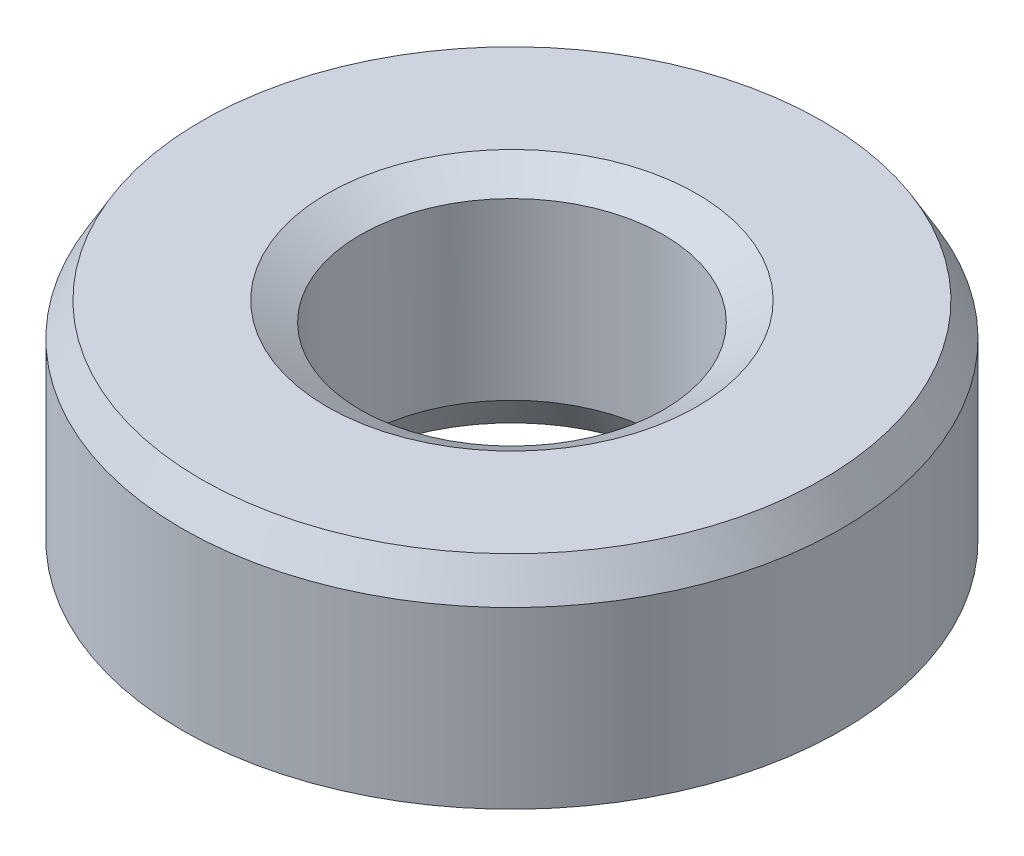
ISO-10303-21;
HEADER;
FILE_DESCRIPTION(('STEP AP214'),'2;1');
FILE_NAME('part.step','',(''),(''),'','','');
FILE_SCHEMA(('AUTOMOTIVE_DESIGN { 1 0 10303 214 1 1 1 1 }'));
ENDSEC;
DATA;
#1=APPLICATION_CONTEXT('core data for automotive mechanical design processes');
#2=APPLICATION_PROTOCOL_DEFINITION('international standard','automotive_design',2000,#1);
#3=PRODUCT_CONTEXT('',#1,'mechanical');
#4=PRODUCT('Part','Part','',(#3));
#5=PRODUCT_RELATED_PRODUCT_CATEGORY('part','',(#4));
#6=PRODUCT_DEFINITION_FORMATION('','',#4);
#7=PRODUCT_DEFINITION_CONTEXT('part definition',#1,'design');
#8=PRODUCT_DEFINITION('design','',#6,#7);
#9=PRODUCT_DEFINITION_SHAPE('','',#8);
#10=(LENGTH_UNIT() NAMED_UNIT(*) SI_UNIT(.MILLI.,.METRE.));
#11=(NAMED_UNIT(*) PLANE_ANGLE_UNIT() SI_UNIT($,.RADIAN.));
#12=(NAMED_UNIT(*) SI_UNIT($,.STERADIAN.) SOLID_ANGLE_UNIT());
#13=UNCERTAINTY_MEASURE_WITH_UNIT(LENGTH_MEASURE(1.E-05),#10,'distance_accuracy_value','');
#14=(GEOMETRIC_REPRESENTATION_CONTEXT(3) GLOBAL_UNCERTAINTY_ASSIGNED_CONTEXT((#13)) GLOBAL_UNIT_ASSIGNED_CONTEXT((#10,
#11,#12)) REPRESENTATION_CONTEXT('',''));
#15=CARTESIAN_POINT('',(0.,0.,0.));
#16=DIRECTION('',(0.,0.,1.));
#17=DIRECTION('',(1.,0.,0.));
#18=AXIS2_PLACEMENT_3D('',#15,#16,#17);
#19=CARTESIAN_POINT('',(0.,12.0487950330754,0.));
#20=DIRECTION('',(0.,-1.,0.));
#21=DIRECTION('',(0.,0.,-1.));
#22=AXIS2_PLACEMENT_3D('',#19,#20,#21);
#23=CYLINDRICAL_SURFACE('',#22,17.5);
#24=CARTESIAN_POINT('',(0.,1.01529997024316,0.));
#25=DIRECTION('',(0.,1.,0.));
#26=DIRECTION('',(0.,0.,1.));
#27=AXIS2_PLACEMENT_3D('',#24,#25,#26);
#28=CIRCLE('',#27,17.5);
#29=CARTESIAN_POINT('',(0.,1.01529997024316,17.5));
#30=VERTEX_POINT('',#29);
#31=EDGE_CURVE('E10',#30,#30,#28,.T.);
#32=ORIENTED_EDGE('',*,*,#31,.T.);
#33=EDGE_LOOP('',(#32));
#34=FACE_BOUND('',#33,.T.);
#35=CARTESIAN_POINT('',(0.,10.290243899691,0.));
#36=DIRECTION('',(0.,1.,0.));
#37=DIRECTION('',(0.,0.,1.));
#38=AXIS2_PLACEMENT_3D('',#35,#36,#37);
#39=CIRCLE('',#38,17.5);
#40=CARTESIAN_POINT('',(0.,10.290243899691,17.5));
#41=VERTEX_POINT('',#40);
#42=EDGE_CURVE('E50',#41,#41,#39,.F.);
#43=ORIENTED_EDGE('',*,*,#42,.T.);
#44=EDGE_LOOP('',(#43));
#45=FACE_BOUND('',#44,.T.);
#46=ADVANCED_FACE('F39',(#34,#45),#23,.T.);
#47=CARTESIAN_POINT('',(0.,12.0487950330754,0.));
#48=DIRECTION('',(0.,1.,0.));
#49=DIRECTION('',(0.,0.,1.));
#50=AXIS2_PLACEMENT_3D('',#47,#48,#49);
#51=PLANE('',#50);
#52=CARTESIAN_POINT('',(0.,12.0487950330754,0.));
#53=DIRECTION('',(0.,1.,0.));
#54=DIRECTION('',(0.,0.,1.));
#55=AXIS2_PLACEMENT_3D('',#52,#53,#54);
#56=CIRCLE('',#55,9.80842316842254);
#57=CARTESIAN_POINT('',(0.,12.0487950330754,9.80842316842254));
#58=VERTEX_POINT('',#57);
#59=EDGE_CURVE('E58',#58,#58,#56,.F.);
#60=ORIENTED_EDGE('',*,*,#59,.T.);
#61=EDGE_LOOP('',(#60));
#62=FACE_BOUND('',#61,.T.);
#63=CARTESIAN_POINT('',(0.,12.0487950330754,0.));
#64=DIRECTION('',(0.,1.,0.));
#65=DIRECTION('',(0.,0.,1.));
#66=AXIS2_PLACEMENT_3D('',#63,#64,#65);
#67=CIRCLE('',#66,16.4847000297568);
#68=CARTESIAN_POINT('',(0.,12.0487950330754,16.4847000297568));
#69=VERTEX_POINT('',#68);
#70=EDGE_CURVE('E61',#69,#69,#67,.T.);
#71=ORIENTED_EDGE('',*,*,#70,.T.);
#72=EDGE_LOOP('',(#71));
#73=FACE_BOUND('',#72,.T.);
#74=ADVANCED_FACE('F88',(#62,#73),#51,.T.);
#75=CARTESIAN_POINT('',(0.,0.,0.));
#76=DIRECTION('',(0.,1.,0.));
#77=DIRECTION('',(0.,0.,1.));
#78=AXIS2_PLACEMENT_3D('',#75,#76,#77);
#79=PLANE('',#78);
#80=CARTESIAN_POINT('',(0.,0.,0.));
#81=DIRECTION('',(0.,1.,0.));
#82=DIRECTION('',(0.,0.,1.));
#83=AXIS2_PLACEMENT_3D('',#80,#81,#82);
#84=CIRCLE('',#83,9.06517200528137);
#85=CARTESIAN_POINT('',(0.,0.,-9.06517200528137));
#86=VERTEX_POINT('',#85);
#87=EDGE_CURVE('E51',#86,#86,#84,.T.);
#88=ORIENTED_EDGE('',*,*,#87,.T.);
#89=EDGE_LOOP('',(#88));
#90=FACE_BOUND('',#89,.T.);
#91=CARTESIAN_POINT('',(0.,0.,0.));
#92=DIRECTION('',(0.,1.,0.));
#93=DIRECTION('',(0.,0.,1.));
#94=AXIS2_PLACEMENT_3D('',#91,#92,#93);
#95=CIRCLE('',#94,15.7414488666157);
#96=CARTESIAN_POINT('',(0.,0.,15.7414488666157));
#97=VERTEX_POINT('',#96);
#98=EDGE_CURVE('E54',#97,#97,#95,.F.);
#99=ORIENTED_EDGE('',*,*,#98,.T.);
#100=EDGE_LOOP('',(#99));
#101=FACE_BOUND('',#100,.T.);
#102=ADVANCED_FACE('F83',(#90,#101),#79,.F.);
#103=CARTESIAN_POINT('',(0.,12.0487950330754,0.));
#104=DIRECTION('',(0.,-1.,0.));
#105=DIRECTION('',(0.,0.,-1.));
#106=AXIS2_PLACEMENT_3D('',#103,#104,#105);
#107=CYLINDRICAL_SURFACE('',#106,8.0498720350382);
#108=CARTESIAN_POINT('',(0.,11.0334950628322,0.));
#109=DIRECTION('',(0.,1.,0.));
#110=DIRECTION('',(0.,0.,1.));
#111=AXIS2_PLACEMENT_3D('',#108,#109,#110);
#112=CIRCLE('',#111,8.0498720350382);
#113=CARTESIAN_POINT('',(0.,11.0334950628322,8.0498720350382));
#114=VERTEX_POINT('',#113);
#115=EDGE_CURVE('E67',#114,#114,#112,.T.);
#116=ORIENTED_EDGE('',*,*,#115,.T.);
#117=EDGE_LOOP('',(#116));
#118=FACE_BOUND('',#117,.T.);
#119=CARTESIAN_POINT('',(0.,1.75855113338434,0.));
#120=DIRECTION('',(0.,1.,0.));
#121=DIRECTION('',(0.,0.,1.));
#122=AXIS2_PLACEMENT_3D('',#119,#120,#121);
#123=CIRCLE('',#122,8.0498720350382);
#124=CARTESIAN_POINT('',(0.,1.75855113338434,-8.0498720350382));
#125=VERTEX_POINT('',#124);
#126=EDGE_CURVE('E69',#125,#125,#123,.F.);
#127=ORIENTED_EDGE('',*,*,#126,.T.);
#128=EDGE_LOOP('',(#127));
#129=FACE_BOUND('',#128,.T.);
#130=ADVANCED_FACE('F71',(#118,#129),#107,.F.);
#131=CARTESIAN_POINT('',(0.,11.0334950628322,0.));
#132=DIRECTION('',(0.,1.,0.));
#133=DIRECTION('',(0.,0.,1.));
#134=AXIS2_PLACEMENT_3D('',#131,#132,#133);
#135=CONICAL_SURFACE('',#134,8.0498720350382,1.0471975511966);
#136=ORIENTED_EDGE('',*,*,#59,.F.);
#137=EDGE_LOOP('',(#136));
#138=FACE_BOUND('',#137,.T.);
#139=ORIENTED_EDGE('',*,*,#115,.F.);
#140=EDGE_LOOP('',(#139));
#141=FACE_BOUND('',#140,.T.);
#142=ADVANCED_FACE('F77',(#138,#141),#135,.F.);
#143=CARTESIAN_POINT('',(0.,0.,0.));
#144=DIRECTION('',(0.,-1.,0.));
#145=DIRECTION('',(0.,0.,-1.));
#146=AXIS2_PLACEMENT_3D('',#143,#144,#145);
#147=CONICAL_SURFACE('',#146,9.06517200528137,0.523598775598295);
#148=CARTESIAN_POINT('',(0.,1.75855113338434,-8.0498720350382));
#149=CARTESIAN_POINT('',(0.,1.74023289241159,-8.0604480763949));
#150=CARTESIAN_POINT('',(0.,1.72191465143883,-8.0710241177516));
#151=CARTESIAN_POINT('',(0.,1.68527816949333,-8.092176200465));
#152=CARTESIAN_POINT('',(0.,1.66695992852057,-8.1027522418217));
#153=CARTESIAN_POINT('',(0.,1.63032344657507,-8.1239043245351));
#154=CARTESIAN_POINT('',(0.,1.61200520560231,-8.1344803658918));
#155=CARTESIAN_POINT('',(0.,1.57536872365681,-8.1556324486052));
#156=CARTESIAN_POINT('',(0.,1.55705048268405,-8.1662084899619));
#157=CARTESIAN_POINT('',(0.,1.52041400073854,-8.1873605726753));
#158=CARTESIAN_POINT('',(0.,1.50209575976579,-8.197936614032));
#159=CARTESIAN_POINT('',(0.,1.46545927782028,-8.2190886967454));
#160=CARTESIAN_POINT('',(0.,1.44714103684753,-8.2296647381021));
#161=CARTESIAN_POINT('',(0.,1.41050455490202,-8.25081682081549));
#162=CARTESIAN_POINT('',(0.,1.39218631392927,-8.2613928621722));
#163=CARTESIAN_POINT('',(0.,1.35554983198376,-8.2825449448856));
#164=CARTESIAN_POINT('',(0.,1.33723159101101,-8.29312098624229));
#165=CARTESIAN_POINT('',(0.,1.3005951090655,-8.31427306895569));
#166=CARTESIAN_POINT('',(0.,1.28227686809275,-8.32484911031239));
#167=CARTESIAN_POINT('',(0.,1.24564038614724,-8.34600119302579));
#168=CARTESIAN_POINT('',(0.,1.22732214517449,-8.35657723438249));
#169=CARTESIAN_POINT('',(0.,1.19068566322898,-8.37772931709589));
#170=CARTESIAN_POINT('',(0.,1.17236742225623,-8.38830535845259));
#171=CARTESIAN_POINT('',(0.,1.13573094031072,-8.40945744116599));
#172=CARTESIAN_POINT('',(0.,1.11741269933797,-8.42003348252269));
#173=CARTESIAN_POINT('',(0.,1.08077621739246,-8.44118556523609));
#174=CARTESIAN_POINT('',(0.,1.06245797641971,-8.45176160659279));
#175=CARTESIAN_POINT('',(0.,1.0258214944742,-8.47291368930619));
#176=CARTESIAN_POINT('',(0.,1.00750325350144,-8.48348973066289));
#177=CARTESIAN_POINT('',(0.,0.970866771555938,-8.50464181337628));
#178=CARTESIAN_POINT('',(0.,0.952548530583184,-8.51521785473299));
#179=CARTESIAN_POINT('',(0.,0.915912048637677,-8.53636993744638));
#180=CARTESIAN_POINT('',(0.,0.897593807664924,-8.54694597880309));
#181=CARTESIAN_POINT('',(0.,0.860957325719417,-8.56809806151648));
#182=CARTESIAN_POINT('',(0.,0.842639084746663,-8.57867410287318));
#183=CARTESIAN_POINT('',(0.,0.806002602801156,-8.59982618558658));
#184=CARTESIAN_POINT('',(0.,0.787684361828403,-8.61040222694328));
#185=CARTESIAN_POINT('',(0.,0.751047879882895,-8.63155430965668));
#186=CARTESIAN_POINT('',(0.,0.732729638910142,-8.64213035101338));
#187=CARTESIAN_POINT('',(0.,0.696093156964635,-8.66328243372678));
#188=CARTESIAN_POINT('',(0.,0.677774915991881,-8.67385847508348));
#189=CARTESIAN_POINT('',(0.,0.641138434046374,-8.69501055779688));
#190=CARTESIAN_POINT('',(0.,0.62282019307362,-8.70558659915358));
#191=CARTESIAN_POINT('',(0.,0.586183711128113,-8.72673868186698));
#192=CARTESIAN_POINT('',(0.,0.56786547015536,-8.73731472322368));
#193=CARTESIAN_POINT('',(0.,0.531228988209853,-8.75846680593708));
#194=CARTESIAN_POINT('',(0.,0.512910747237099,-8.76904284729378));
#195=CARTESIAN_POINT('',(0.,0.476274265291592,-8.79019493000717));
#196=CARTESIAN_POINT('',(0.,0.457956024318839,-8.80077097136388));
#197=CARTESIAN_POINT('',(0.,0.421319542373332,-8.82192305407727));
#198=CARTESIAN_POINT('',(0.,0.403001301400578,-8.83249909543397));
#199=CARTESIAN_POINT('',(0.,0.366364819455071,-8.85365117814737));
#200=CARTESIAN_POINT('',(0.,0.348046578482317,-8.86422721950407));
#201=CARTESIAN_POINT('',(0.,0.31141009653681,-8.88537930221747));
#202=CARTESIAN_POINT('',(0.,0.293091855564057,-8.89595534357417));
#203=CARTESIAN_POINT('',(0.,0.25645537361855,-8.91710742628757));
#204=CARTESIAN_POINT('',(0.,0.238137132645796,-8.92768346764427));
#205=CARTESIAN_POINT('',(0.,0.201500650700289,-8.94883555035767));
#206=CARTESIAN_POINT('',(0.,0.183182409727535,-8.95941159171437));
#207=CARTESIAN_POINT('',(0.,0.146545927782028,-8.98056367442777));
#208=CARTESIAN_POINT('',(0.,0.128227686809275,-8.99113971578447));
#209=CARTESIAN_POINT('',(0.,0.091591204863768,-9.01229179849787));
#210=CARTESIAN_POINT('',(0.,0.0732729638910143,-9.02286783985457));
#211=CARTESIAN_POINT('',(0.,0.0366364819455069,-9.04401992256797));
#212=CARTESIAN_POINT('',(0.,0.0183182409727531,-9.05459596392466));
#213=CARTESIAN_POINT('',(0.,0.,-9.06517200528137));
#214=B_SPLINE_CURVE_WITH_KNOTS('',3,(#148,#149,#150,#151,#152,#153,#154,#155,#156,#157,#158,
#159,#160,#161,#162,#163,#164,#165,#166,#167,#168,#169,#170,#171,#172,#173,#174,#175,#176,#177,
#178,#179,#180,#181,#182,#183,#184,#185,#186,#187,#188,#189,#190,#191,#192,#193,#194,#195,#196,
#197,#198,#199,#200,#201,#202,#203,#204,#205,#206,#207,#208,#209,#210,#211,#212,#213),
.UNSPECIFIED.,.F.,.F.,(4,2,2,2,2,2,2,2,2,2,2,2,2,2,2,2,2,2,2,2,2,2,2,2,2,2,2,2,2,2,2,2,4),(0.,
0.0634562481401976,0.126912496280396,0.190368744420594,0.253824992560792,0.317281240700991,
0.380737488841188,0.444193736981386,0.507649985121584,0.571106233261783,0.63456248140198,
0.698018729542178,0.761474977682376,0.824931225822575,0.888387473962772,0.951843722102971,
1.01529997024317,1.07875621838337,1.14221246652357,1.20566871466376,1.26912496280396,
1.33258121094416,1.39603745908436,1.45949370722455,1.52294995536475,1.58640620350495,
1.64986245164515,1.71331869978535,1.77677494792554,1.84023119606574,1.90368744420594,
1.96714369234614,2.03059994048634),.UNSPECIFIED.);
#215=EDGE_CURVE('BSEAM73',#125,#86,#214,.T.);
#216=ORIENTED_EDGE('',*,*,#126,.F.);
#217=ORIENTED_EDGE('',*,*,#87,.F.);
#218=ORIENTED_EDGE('',*,*,#215,.T.);
#219=ORIENTED_EDGE('',*,*,#215,.F.);
#220=EDGE_LOOP('',(#216,#218,#217,#219));
#221=FACE_BOUND('',#220,.T.);
#222=ADVANCED_FACE('F73',(#221),#147,.F.);
#223=CARTESIAN_POINT('',(0.,1.01529997024316,0.));
#224=DIRECTION('',(0.,1.,0.));
#225=DIRECTION('',(0.,0.,1.));
#226=AXIS2_PLACEMENT_3D('',#223,#224,#225);
#227=CONICAL_SURFACE('',#226,17.5,1.0471975511966);
#228=ORIENTED_EDGE('',*,*,#98,.F.);
#229=EDGE_LOOP('',(#228));
#230=FACE_BOUND('',#229,.T.);
#231=ORIENTED_EDGE('',*,*,#31,.F.);
#232=EDGE_LOOP('',(#231));
#233=FACE_BOUND('',#232,.T.);
#234=ADVANCED_FACE('F76',(#230,#233),#227,.T.);
#235=CARTESIAN_POINT('',(0.,12.0487950330754,0.));
#236=DIRECTION('',(0.,-1.,0.));
#237=DIRECTION('',(0.,0.,-1.));
#238=AXIS2_PLACEMENT_3D('',#235,#236,#237);
#239=CONICAL_SURFACE('',#238,16.4847000297568,0.523598775598296);
#240=ORIENTED_EDGE('',*,*,#42,.F.);
#241=EDGE_LOOP('',(#240));
#242=FACE_BOUND('',#241,.T.);
#243=ORIENTED_EDGE('',*,*,#70,.F.);
#244=EDGE_LOOP('',(#243));
#245=FACE_BOUND('',#244,.T.);
#246=ADVANCED_FACE('F45',(#242,#245),#239,.T.);
#247=CLOSED_SHELL('',(#46,#74,#102,#130,#142,#222,#234,#246));
#248=MANIFOLD_SOLID_BREP('B2',#247);
#249=ADVANCED_BREP_SHAPE_REPRESENTATION('',(#18,#248),#14);
#250=SHAPE_DEFINITION_REPRESENTATION(#9,#249);
ENDSEC;
END-ISO-10303-21;
